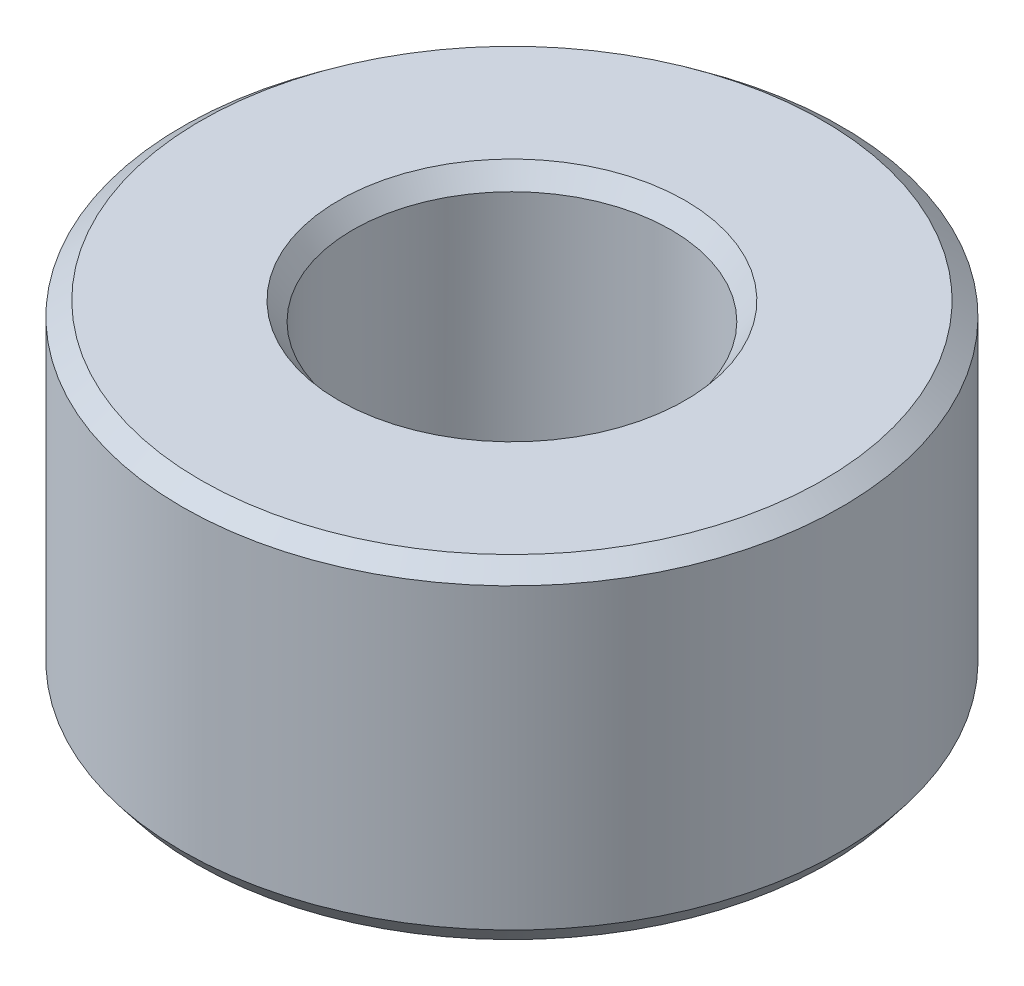
ISO-10303-21;
HEADER;
FILE_DESCRIPTION(('STEP AP214'),'2;1');
FILE_NAME('part.step','',(''),(''),'','','');
FILE_SCHEMA(('AUTOMOTIVE_DESIGN { 1 0 10303 214 1 1 1 1 }'));
ENDSEC;
DATA;
#1=APPLICATION_CONTEXT('core data for automotive mechanical design processes');
#2=APPLICATION_PROTOCOL_DEFINITION('international standard','automotive_design',2000,#1);
#3=PRODUCT_CONTEXT('',#1,'mechanical');
#4=PRODUCT('Part','Part','',(#3));
#5=PRODUCT_RELATED_PRODUCT_CATEGORY('part','',(#4));
#6=PRODUCT_DEFINITION_FORMATION('','',#4);
#7=PRODUCT_DEFINITION_CONTEXT('part definition',#1,'design');
#8=PRODUCT_DEFINITION('design','',#6,#7);
#9=PRODUCT_DEFINITION_SHAPE('','',#8);
#10=(LENGTH_UNIT() NAMED_UNIT(*) SI_UNIT(.MILLI.,.METRE.));
#11=(NAMED_UNIT(*) PLANE_ANGLE_UNIT() SI_UNIT($,.RADIAN.));
#12=(NAMED_UNIT(*) SI_UNIT($,.STERADIAN.) SOLID_ANGLE_UNIT());
#13=UNCERTAINTY_MEASURE_WITH_UNIT(LENGTH_MEASURE(1.E-05),#10,'distance_accuracy_value','');
#14=(GEOMETRIC_REPRESENTATION_CONTEXT(3) GLOBAL_UNCERTAINTY_ASSIGNED_CONTEXT((#13)) GLOBAL_UNIT_ASSIGNED_CONTEXT((#10,
#11,#12)) REPRESENTATION_CONTEXT('',''));
#15=CARTESIAN_POINT('',(0.,0.,0.));
#16=DIRECTION('',(0.,0.,1.));
#17=DIRECTION('',(1.,0.,0.));
#18=AXIS2_PLACEMENT_3D('',#15,#16,#17);
#19=CARTESIAN_POINT('',(0.,52.6571193030339,0.));
#20=DIRECTION('',(0.,-1.,0.));
#21=DIRECTION('',(0.,0.,-1.));
#22=AXIS2_PLACEMENT_3D('',#19,#20,#21);
#23=CYLINDRICAL_SURFACE('',#22,52.5);
#24=CARTESIAN_POINT('',(0.,2.91728491052555,0.));
#25=DIRECTION('',(0.,1.,0.));
#26=DIRECTION('',(0.,0.,1.));
#27=AXIS2_PLACEMENT_3D('',#24,#25,#26);
#28=CIRCLE('',#27,52.5);
#29=CARTESIAN_POINT('',(0.,2.91728491052555,52.5));
#30=VERTEX_POINT('',#29);
#31=EDGE_CURVE('E10',#30,#30,#28,.T.);
#32=ORIENTED_EDGE('',*,*,#31,.T.);
#33=EDGE_LOOP('',(#32));
#34=FACE_BOUND('',#33,.T.);
#35=CARTESIAN_POINT('',(0.,50.398238770074,0.));
#36=DIRECTION('',(0.,1.,0.));
#37=DIRECTION('',(0.,0.,1.));
#38=AXIS2_PLACEMENT_3D('',#35,#36,#37);
#39=CIRCLE('',#38,52.5);
#40=CARTESIAN_POINT('',(0.,50.398238770074,52.5));
#41=VERTEX_POINT('',#40);
#42=EDGE_CURVE('E50',#41,#41,#39,.F.);
#43=ORIENTED_EDGE('',*,*,#42,.T.);
#44=EDGE_LOOP('',(#43));
#45=FACE_BOUND('',#44,.T.);
#46=ADVANCED_FACE('F39',(#34,#45),#23,.T.);
#47=CARTESIAN_POINT('',(0.,52.6571193030339,0.));
#48=DIRECTION('',(0.,1.,0.));
#49=DIRECTION('',(0.,0.,1.));
#50=AXIS2_PLACEMENT_3D('',#47,#48,#49);
#51=PLANE('',#50);
#52=CARTESIAN_POINT('',(0.,52.6571193030339,0.));
#53=DIRECTION('',(0.,1.,0.));
#54=DIRECTION('',(0.,0.,1.));
#55=AXIS2_PLACEMENT_3D('',#52,#53,#54);
#56=CIRCLE('',#55,27.5938731222192);
#57=CARTESIAN_POINT('',(0.,52.6571193030339,27.5938731222192));
#58=VERTEX_POINT('',#57);
#59=EDGE_CURVE('E58',#58,#58,#56,.F.);
#60=ORIENTED_EDGE('',*,*,#59,.T.);
#61=EDGE_LOOP('',(#60));
#62=FACE_BOUND('',#61,.T.);
#63=CARTESIAN_POINT('',(0.,52.6571193030339,0.));
#64=DIRECTION('',(0.,1.,0.));
#65=DIRECTION('',(0.,0.,1.));
#66=AXIS2_PLACEMENT_3D('',#63,#64,#65);
#67=CIRCLE('',#66,49.5827150894744);
#68=CARTESIAN_POINT('',(0.,52.6571193030339,49.5827150894744));
#69=VERTEX_POINT('',#68);
#70=EDGE_CURVE('E61',#69,#69,#67,.T.);
#71=ORIENTED_EDGE('',*,*,#70,.T.);
#72=EDGE_LOOP('',(#71));
#73=FACE_BOUND('',#72,.T.);
#74=ADVANCED_FACE('F88',(#62,#73),#51,.T.);
#75=CARTESIAN_POINT('',(0.,0.,0.));
#76=DIRECTION('',(0.,1.,0.));
#77=DIRECTION('',(0.,0.,1.));
#78=AXIS2_PLACEMENT_3D('',#75,#76,#77);
#79=PLANE('',#78);
#80=CARTESIAN_POINT('',(0.,0.,0.));
#81=DIRECTION('',(0.,1.,0.));
#82=DIRECTION('',(0.,0.,1.));
#83=AXIS2_PLACEMENT_3D('',#80,#81,#82);
#84=CIRCLE('',#83,28.2522774997848);
#85=CARTESIAN_POINT('',(0.,0.,-28.2522774997848));
#86=VERTEX_POINT('',#85);
#87=EDGE_CURVE('E51',#86,#86,#84,.T.);
#88=ORIENTED_EDGE('',*,*,#87,.T.);
#89=EDGE_LOOP('',(#88));
#90=FACE_BOUND('',#89,.T.);
#91=CARTESIAN_POINT('',(0.,0.,0.));
#92=DIRECTION('',(0.,1.,0.));
#93=DIRECTION('',(0.,0.,1.));
#94=AXIS2_PLACEMENT_3D('',#91,#92,#93);
#95=CIRCLE('',#94,50.2411194670401);
#96=CARTESIAN_POINT('',(0.,0.,50.2411194670401));
#97=VERTEX_POINT('',#96);
#98=EDGE_CURVE('E54',#97,#97,#95,.F.);
#99=ORIENTED_EDGE('',*,*,#98,.T.);
#100=EDGE_LOOP('',(#99));
#101=FACE_BOUND('',#100,.T.);
#102=ADVANCED_FACE('F83',(#90,#101),#79,.F.);
#103=CARTESIAN_POINT('',(0.,52.6571193030339,0.));
#104=DIRECTION('',(0.,-1.,0.));
#105=DIRECTION('',(0.,0.,-1.));
#106=AXIS2_PLACEMENT_3D('',#103,#104,#105);
#107=CYLINDRICAL_SURFACE('',#106,25.3349925892593);
#108=CARTESIAN_POINT('',(0.,49.7398343925084,0.));
#109=DIRECTION('',(0.,1.,0.));
#110=DIRECTION('',(0.,0.,1.));
#111=AXIS2_PLACEMENT_3D('',#108,#109,#110);
#112=CIRCLE('',#111,25.3349925892593);
#113=CARTESIAN_POINT('',(0.,49.7398343925084,25.3349925892593));
#114=VERTEX_POINT('',#113);
#115=EDGE_CURVE('E67',#114,#114,#112,.T.);
#116=ORIENTED_EDGE('',*,*,#115,.T.);
#117=EDGE_LOOP('',(#116));
#118=FACE_BOUND('',#117,.T.);
#119=CARTESIAN_POINT('',(0.,2.25888053295986,0.));
#120=DIRECTION('',(0.,1.,0.));
#121=DIRECTION('',(0.,0.,1.));
#122=AXIS2_PLACEMENT_3D('',#119,#120,#121);
#123=CIRCLE('',#122,25.3349925892593);
#124=CARTESIAN_POINT('',(0.,2.25888053295986,-25.3349925892593));
#125=VERTEX_POINT('',#124);
#126=EDGE_CURVE('E69',#125,#125,#123,.F.);
#127=ORIENTED_EDGE('',*,*,#126,.T.);
#128=EDGE_LOOP('',(#127));
#129=FACE_BOUND('',#128,.T.);
#130=ADVANCED_FACE('F71',(#118,#129),#107,.F.);
#131=CARTESIAN_POINT('',(0.,49.7398343925084,0.));
#132=DIRECTION('',(0.,1.,0.));
#133=DIRECTION('',(0.,0.,1.));
#134=AXIS2_PLACEMENT_3D('',#131,#132,#133);
#135=CONICAL_SURFACE('',#134,25.3349925892593,0.658878339912554);
#136=ORIENTED_EDGE('',*,*,#59,.F.);
#137=EDGE_LOOP('',(#136));
#138=FACE_BOUND('',#137,.T.);
#139=ORIENTED_EDGE('',*,*,#115,.F.);
#140=EDGE_LOOP('',(#139));
#141=FACE_BOUND('',#140,.T.);
#142=ADVANCED_FACE('F77',(#138,#141),#135,.F.);
#143=CARTESIAN_POINT('',(0.,0.,0.));
#144=DIRECTION('',(0.,-1.,0.));
#145=DIRECTION('',(0.,0.,-1.));
#146=AXIS2_PLACEMENT_3D('',#143,#144,#145);
#147=CONICAL_SURFACE('',#146,28.2522774997848,0.911917986882345);
#148=CARTESIAN_POINT('',(0.,2.25888053295986,-25.3349925892593));
#149=CARTESIAN_POINT('',(0.,2.2353505274082,-25.3653809737439));
#150=CARTESIAN_POINT('',(0.,2.21182052185653,-25.3957693582286));
#151=CARTESIAN_POINT('',(0.,2.1647605107532,-25.4565461271979));
#152=CARTESIAN_POINT('',(0.,2.14123050520154,-25.4869345116825));
#153=CARTESIAN_POINT('',(0.,2.0941704940982,-25.5477112806518));
#154=CARTESIAN_POINT('',(0.,2.07064048854654,-25.5780996651364));
#155=CARTESIAN_POINT('',(0.,2.02358047744321,-25.6388764341057));
#156=CARTESIAN_POINT('',(0.,2.00005047189154,-25.6692648185904));
#157=CARTESIAN_POINT('',(0.,1.95299046078821,-25.7300415875596));
#158=CARTESIAN_POINT('',(0.,1.92946045523655,-25.7604299720443));
#159=CARTESIAN_POINT('',(0.,1.88240044413322,-25.8212067410136));
#160=CARTESIAN_POINT('',(0.,1.85887043858155,-25.8515951254982));
#161=CARTESIAN_POINT('',(0.,1.81181042747822,-25.9123718944675));
#162=CARTESIAN_POINT('',(0.,1.78828042192656,-25.9427602789521));
#163=CARTESIAN_POINT('',(0.,1.74122041082323,-26.0035370479214));
#164=CARTESIAN_POINT('',(0.,1.71769040527156,-26.033925432406));
#165=CARTESIAN_POINT('',(0.,1.67063039416823,-26.0947022013753));
#166=CARTESIAN_POINT('',(0.,1.64710038861657,-26.12509058586));
#167=CARTESIAN_POINT('',(0.,1.60004037751324,-26.1858673548293));
#168=CARTESIAN_POINT('',(0.,1.57651037196157,-26.2162557393139));
#169=CARTESIAN_POINT('',(0.,1.52945036085824,-26.2770325082832));
#170=CARTESIAN_POINT('',(0.,1.50592035530657,-26.3074208927678));
#171=CARTESIAN_POINT('',(0.,1.45886034420324,-26.3681976617371));
#172=CARTESIAN_POINT('',(0.,1.43533033865158,-26.3985860462217));
#173=CARTESIAN_POINT('',(0.,1.38827032754825,-26.459362815191));
#174=CARTESIAN_POINT('',(0.,1.36474032199658,-26.4897511996757));
#175=CARTESIAN_POINT('',(0.,1.31768031089325,-26.5505279686449));
#176=CARTESIAN_POINT('',(0.,1.29415030534159,-26.5809163531296));
#177=CARTESIAN_POINT('',(0.,1.24709029423826,-26.6416931220989));
#178=CARTESIAN_POINT('',(0.,1.22356028868659,-26.6720815065835));
#179=CARTESIAN_POINT('',(0.,1.17650027758326,-26.7328582755528));
#180=CARTESIAN_POINT('',(0.,1.1529702720316,-26.7632466600374));
#181=CARTESIAN_POINT('',(0.,1.10591026092826,-26.8240234290067));
#182=CARTESIAN_POINT('',(0.,1.0823802553766,-26.8544118134914));
#183=CARTESIAN_POINT('',(0.,1.03532024427327,-26.9151885824606));
#184=CARTESIAN_POINT('',(0.,1.0117902387216,-26.9455769669453));
#185=CARTESIAN_POINT('',(0.,0.964730227618274,-27.0063537359146));
#186=CARTESIAN_POINT('',(0.,0.941200222066609,-27.0367421203992));
#187=CARTESIAN_POINT('',(0.,0.894140210963279,-27.0975188893685));
#188=CARTESIAN_POINT('',(0.,0.870610205411614,-27.1279072738531));
#189=CARTESIAN_POINT('',(0.,0.823550194308283,-27.1886840428224));
#190=CARTESIAN_POINT('',(0.,0.800020188756617,-27.219072427307));
#191=CARTESIAN_POINT('',(0.,0.752960177653287,-27.2798491962763));
#192=CARTESIAN_POINT('',(0.,0.729430172101622,-27.310237580761));
#193=CARTESIAN_POINT('',(0.,0.682370160998292,-27.3710143497303));
#194=CARTESIAN_POINT('',(0.,0.658840155446626,-27.4014027342149));
#195=CARTESIAN_POINT('',(0.,0.611780144343296,-27.4621795031842));
#196=CARTESIAN_POINT('',(0.,0.58825013879163,-27.4925678876688));
#197=CARTESIAN_POINT('',(0.,0.5411901276883,-27.5533446566381));
#198=CARTESIAN_POINT('',(0.,0.517660122136635,-27.5837330411227));
#199=CARTESIAN_POINT('',(0.,0.470600111033305,-27.644509810092));
#200=CARTESIAN_POINT('',(0.,0.447070105481639,-27.6748981945767));
#201=CARTESIAN_POINT('',(0.,0.400010094378308,-27.7356749635459));
#202=CARTESIAN_POINT('',(0.,0.376480088826643,-27.7660633480306));
#203=CARTESIAN_POINT('',(0.,0.329420077723313,-27.8268401169999));
#204=CARTESIAN_POINT('',(0.,0.305890072171648,-27.8572285014845));
#205=CARTESIAN_POINT('',(0.,0.258830061068317,-27.9180052704538));
#206=CARTESIAN_POINT('',(0.,0.235300055516653,-27.9483936549384));
#207=CARTESIAN_POINT('',(0.,0.188240044413322,-28.0091704239077));
#208=CARTESIAN_POINT('',(0.,0.164710038861656,-28.0395588083924));
#209=CARTESIAN_POINT('',(0.,0.117650027758326,-28.1003355773616));
#210=CARTESIAN_POINT('',(0.,0.0941200222066607,-28.1307239618463));
#211=CARTESIAN_POINT('',(0.,0.0470600111033306,-28.1915007308156));
#212=CARTESIAN_POINT('',(0.,0.0235300055516656,-28.2218891153002));
#213=CARTESIAN_POINT('',(0.,0.,-28.2522774997848));
#214=B_SPLINE_CURVE_WITH_KNOTS('',3,(#148,#149,#150,#151,#152,#153,#154,#155,#156,#157,#158,
#159,#160,#161,#162,#163,#164,#165,#166,#167,#168,#169,#170,#171,#172,#173,#174,#175,#176,#177,
#178,#179,#180,#181,#182,#183,#184,#185,#186,#187,#188,#189,#190,#191,#192,#193,#194,#195,#196,
#197,#198,#199,#200,#201,#202,#203,#204,#205,#206,#207,#208,#209,#210,#211,#212,#213),
.UNSPECIFIED.,.F.,.F.,(4,2,2,2,2,2,2,2,2,2,2,2,2,2,2,2,2,2,2,2,2,2,2,2,2,2,2,2,2,2,2,2,4),(0.,
0.115299764334668,0.230599528669337,0.345899293004002,0.461199057338671,0.576498821673339,
0.691798586008007,0.807098350342675,0.922398114677341,1.03769787901201,1.15299764334668,
1.26829740768135,1.38359717201601,1.49889693635068,1.61419670068535,1.72949646502002,
1.84479622935468,1.96009599368935,2.07539575802402,2.19069552235869,2.30599528669336,
2.42129505102802,2.53659481536269,2.65189457969736,2.76719434403203,2.88249410836669,
2.99779387270136,3.11309363703603,3.2283934013707,3.34369316570536,3.45899293004003,
3.5742926943747,3.68959245870937),.UNSPECIFIED.);
#215=EDGE_CURVE('BSEAM73',#125,#86,#214,.T.);
#216=ORIENTED_EDGE('',*,*,#126,.F.);
#217=ORIENTED_EDGE('',*,*,#87,.F.);
#218=ORIENTED_EDGE('',*,*,#215,.T.);
#219=ORIENTED_EDGE('',*,*,#215,.F.);
#220=EDGE_LOOP('',(#216,#218,#217,#219));
#221=FACE_BOUND('',#220,.T.);
#222=ADVANCED_FACE('F73',(#221),#147,.F.);
#223=CARTESIAN_POINT('',(0.,2.91728491052555,0.));
#224=DIRECTION('',(0.,1.,0.));
#225=DIRECTION('',(0.,0.,1.));
#226=AXIS2_PLACEMENT_3D('',#223,#224,#225);
#227=CONICAL_SURFACE('',#226,52.5,0.658878339912552);
#228=ORIENTED_EDGE('',*,*,#98,.F.);
#229=EDGE_LOOP('',(#228));
#230=FACE_BOUND('',#229,.T.);
#231=ORIENTED_EDGE('',*,*,#31,.F.);
#232=EDGE_LOOP('',(#231));
#233=FACE_BOUND('',#232,.T.);
#234=ADVANCED_FACE('F76',(#230,#233),#227,.T.);
#235=CARTESIAN_POINT('',(0.,52.6571193030339,0.));
#236=DIRECTION('',(0.,-1.,0.));
#237=DIRECTION('',(0.,0.,-1.));
#238=AXIS2_PLACEMENT_3D('',#235,#236,#237);
#239=CONICAL_SURFACE('',#238,49.5827150894744,0.911917986882344);
#240=ORIENTED_EDGE('',*,*,#42,.F.);
#241=EDGE_LOOP('',(#240));
#242=FACE_BOUND('',#241,.T.);
#243=ORIENTED_EDGE('',*,*,#70,.F.);
#244=EDGE_LOOP('',(#243));
#245=FACE_BOUND('',#244,.T.);
#246=ADVANCED_FACE('F45',(#242,#245),#239,.T.);
#247=CLOSED_SHELL('',(#46,#74,#102,#130,#142,#222,#234,#246));
#248=MANIFOLD_SOLID_BREP('B2',#247);
#249=ADVANCED_BREP_SHAPE_REPRESENTATION('',(#18,#248),#14);
#250=SHAPE_DEFINITION_REPRESENTATION(#9,#249);
ENDSEC;
END-ISO-10303-21;
